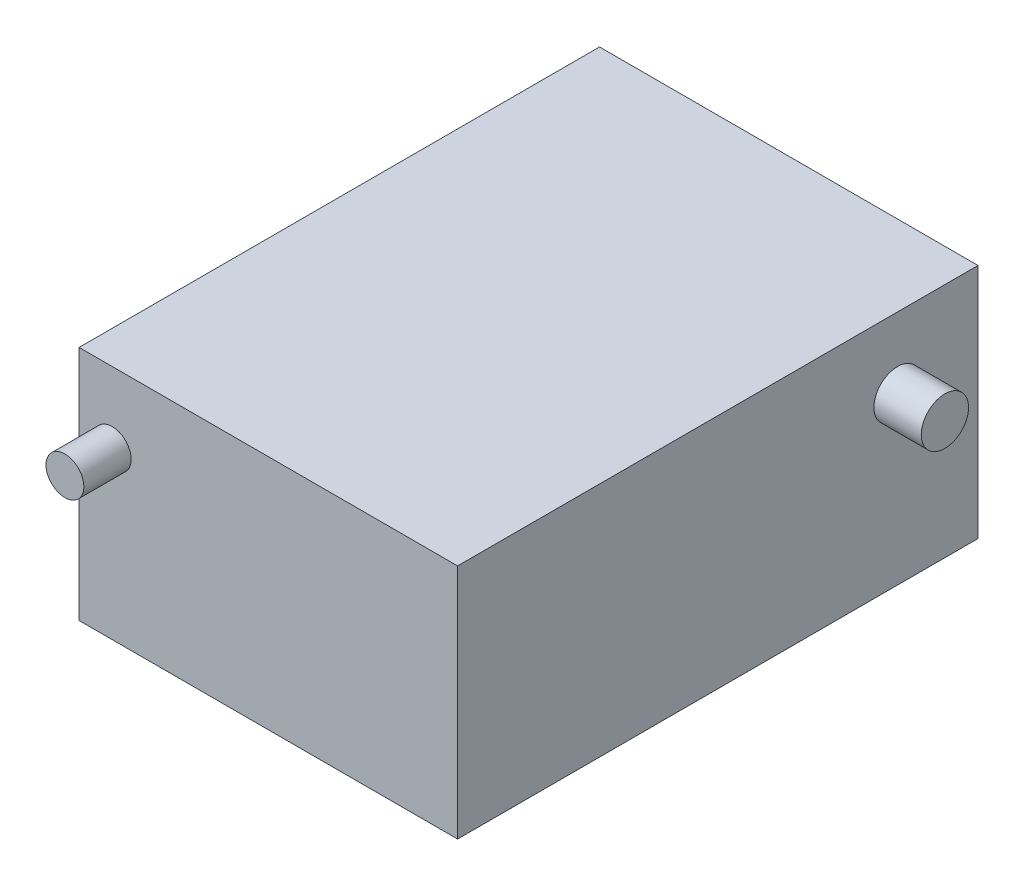
ISO-10303-21;
HEADER;
FILE_DESCRIPTION(('STEP AP214'),'2;1');
FILE_NAME('part.step','',(''),(''),'','','');
FILE_SCHEMA(('AUTOMOTIVE_DESIGN { 1 0 10303 214 1 1 1 1 }'));
ENDSEC;
DATA;
#1=APPLICATION_CONTEXT('core data for automotive mechanical design processes');
#2=APPLICATION_PROTOCOL_DEFINITION('international standard','automotive_design',2000,#1);
#3=PRODUCT_CONTEXT('',#1,'mechanical');
#4=PRODUCT('Part','Part','',(#3));
#5=PRODUCT_RELATED_PRODUCT_CATEGORY('part','',(#4));
#6=PRODUCT_DEFINITION_FORMATION('','',#4);
#7=PRODUCT_DEFINITION_CONTEXT('part definition',#1,'design');
#8=PRODUCT_DEFINITION('design','',#6,#7);
#9=PRODUCT_DEFINITION_SHAPE('','',#8);
#10=(LENGTH_UNIT() NAMED_UNIT(*) SI_UNIT(.MILLI.,.METRE.));
#11=(NAMED_UNIT(*) PLANE_ANGLE_UNIT() SI_UNIT($,.RADIAN.));
#12=(NAMED_UNIT(*) SI_UNIT($,.STERADIAN.) SOLID_ANGLE_UNIT());
#13=UNCERTAINTY_MEASURE_WITH_UNIT(LENGTH_MEASURE(1.E-05),#10,'distance_accuracy_value','');
#14=(GEOMETRIC_REPRESENTATION_CONTEXT(3) GLOBAL_UNCERTAINTY_ASSIGNED_CONTEXT((#13)) GLOBAL_UNIT_ASSIGNED_CONTEXT((#10,
#11,#12)) REPRESENTATION_CONTEXT('',''));
#15=CARTESIAN_POINT('',(0.,0.,0.));
#16=DIRECTION('',(0.,0.,1.));
#17=DIRECTION('',(1.,0.,0.));
#18=AXIS2_PLACEMENT_3D('',#15,#16,#17);
#19=CARTESIAN_POINT('',(80.,0.,0.));
#20=DIRECTION('',(0.,0.,-1.));
#21=DIRECTION('',(-1.,0.,0.));
#22=AXIS2_PLACEMENT_3D('',#19,#20,#21);
#23=PLANE('',#22);
#24=CARTESIAN_POINT('',(7.,35.,0.));
#25=DIRECTION('',(0.,0.,-1.));
#26=DIRECTION('',(-1.,0.,0.));
#27=AXIS2_PLACEMENT_3D('',#24,#25,#26);
#28=CIRCLE('',#27,4.);
#29=CARTESIAN_POINT('',(3.,35.,0.));
#30=VERTEX_POINT('',#29);
#31=EDGE_CURVE('E48',#30,#30,#28,.F.);
#32=ORIENTED_EDGE('',*,*,#31,.F.);
#33=EDGE_LOOP('',(#32));
#34=FACE_BOUND('',#33,.T.);
#35=DIRECTION('',(0.,-1.,0.));
#36=VECTOR('',#35,1.);
#37=CARTESIAN_POINT('',(0.,0.,0.));
#38=LINE('',#37,#36);
#39=CARTESIAN_POINT('',(0.,50.,0.));
#40=VERTEX_POINT('',#39);
#41=CARTESIAN_POINT('',(0.,0.,0.));
#42=VERTEX_POINT('',#41);
#43=EDGE_CURVE('E111',#40,#42,#38,.T.);
#44=ORIENTED_EDGE('',*,*,#43,.T.);
#45=DIRECTION('',(-1.,0.,0.));
#46=VECTOR('',#45,1.);
#47=CARTESIAN_POINT('',(80.,0.,0.));
#48=LINE('',#47,#46);
#49=CARTESIAN_POINT('',(80.,0.,0.));
#50=VERTEX_POINT('',#49);
#51=EDGE_CURVE('E100',#50,#42,#48,.T.);
#52=ORIENTED_EDGE('',*,*,#51,.F.);
#53=DIRECTION('',(0.,-1.,0.));
#54=VECTOR('',#53,1.);
#55=CARTESIAN_POINT('',(80.,0.,0.));
#56=LINE('',#55,#54);
#57=CARTESIAN_POINT('',(80.,50.,0.));
#58=VERTEX_POINT('',#57);
#59=EDGE_CURVE('E92',#58,#50,#56,.T.);
#60=ORIENTED_EDGE('',*,*,#59,.F.);
#61=DIRECTION('',(-1.,0.,0.));
#62=VECTOR('',#61,1.);
#63=CARTESIAN_POINT('',(80.,50.,0.));
#64=LINE('',#63,#62);
#65=EDGE_CURVE('E107',#58,#40,#64,.T.);
#66=ORIENTED_EDGE('',*,*,#65,.T.);
#67=EDGE_LOOP('',(#44,#52,#60,#66));
#68=FACE_BOUND('',#67,.T.);
#69=ADVANCED_FACE('F39',(#34,#68),#23,.F.);
#70=CARTESIAN_POINT('',(80.,0.,0.));
#71=DIRECTION('',(0.,1.,0.));
#72=DIRECTION('',(0.,0.,1.));
#73=AXIS2_PLACEMENT_3D('',#70,#71,#72);
#74=PLANE('',#73);
#75=DIRECTION('',(0.,0.,-1.));
#76=VECTOR('',#75,1.);
#77=CARTESIAN_POINT('',(0.,0.,0.));
#78=LINE('',#77,#76);
#79=CARTESIAN_POINT('',(0.,0.,-110.));
#80=VERTEX_POINT('',#79);
#81=EDGE_CURVE('E98',#42,#80,#78,.T.);
#82=ORIENTED_EDGE('',*,*,#81,.T.);
#83=DIRECTION('',(-1.,0.,0.));
#84=VECTOR('',#83,1.);
#85=CARTESIAN_POINT('',(80.,0.,-110.));
#86=LINE('',#85,#84);
#87=CARTESIAN_POINT('',(80.,0.,-110.));
#88=VERTEX_POINT('',#87);
#89=EDGE_CURVE('E96',#88,#80,#86,.T.);
#90=ORIENTED_EDGE('',*,*,#89,.F.);
#91=DIRECTION('',(0.,0.,-1.));
#92=VECTOR('',#91,1.);
#93=CARTESIAN_POINT('',(80.,0.,0.));
#94=LINE('',#93,#92);
#95=EDGE_CURVE('E87',#50,#88,#94,.T.);
#96=ORIENTED_EDGE('',*,*,#95,.F.);
#97=ORIENTED_EDGE('',*,*,#51,.T.);
#98=EDGE_LOOP('',(#82,#90,#96,#97));
#99=FACE_BOUND('',#98,.T.);
#100=ADVANCED_FACE('F97',(#99),#74,.F.);
#101=CARTESIAN_POINT('',(80.,0.,-110.));
#102=DIRECTION('',(0.,0.,1.));
#103=DIRECTION('',(1.,0.,0.));
#104=AXIS2_PLACEMENT_3D('',#101,#102,#103);
#105=PLANE('',#104);
#106=DIRECTION('',(0.,1.,0.));
#107=VECTOR('',#106,1.);
#108=CARTESIAN_POINT('',(0.,0.,-110.));
#109=LINE('',#108,#107);
#110=CARTESIAN_POINT('',(0.,50.,-110.));
#111=VERTEX_POINT('',#110);
#112=EDGE_CURVE('E73',#80,#111,#109,.T.);
#113=ORIENTED_EDGE('',*,*,#112,.T.);
#114=DIRECTION('',(-1.,0.,0.));
#115=VECTOR('',#114,1.);
#116=CARTESIAN_POINT('',(80.,50.,-110.));
#117=LINE('',#116,#115);
#118=CARTESIAN_POINT('',(80.,50.,-110.));
#119=VERTEX_POINT('',#118);
#120=EDGE_CURVE('E101',#119,#111,#117,.T.);
#121=ORIENTED_EDGE('',*,*,#120,.F.);
#122=DIRECTION('',(0.,1.,0.));
#123=VECTOR('',#122,1.);
#124=CARTESIAN_POINT('',(80.,0.,-110.));
#125=LINE('',#124,#123);
#126=EDGE_CURVE('E90',#88,#119,#125,.T.);
#127=ORIENTED_EDGE('',*,*,#126,.F.);
#128=ORIENTED_EDGE('',*,*,#89,.T.);
#129=EDGE_LOOP('',(#113,#121,#127,#128));
#130=FACE_BOUND('',#129,.T.);
#131=ADVANCED_FACE('F103',(#130),#105,.F.);
#132=CARTESIAN_POINT('',(80.,50.,0.));
#133=DIRECTION('',(0.,-1.,0.));
#134=DIRECTION('',(0.,0.,-1.));
#135=AXIS2_PLACEMENT_3D('',#132,#133,#134);
#136=PLANE('',#135);
#137=DIRECTION('',(0.,0.,1.));
#138=VECTOR('',#137,1.);
#139=CARTESIAN_POINT('',(0.,50.,0.));
#140=LINE('',#139,#138);
#141=EDGE_CURVE('E79',#111,#40,#140,.T.);
#142=ORIENTED_EDGE('',*,*,#141,.T.);
#143=ORIENTED_EDGE('',*,*,#65,.F.);
#144=DIRECTION('',(0.,0.,1.));
#145=VECTOR('',#144,1.);
#146=CARTESIAN_POINT('',(80.,50.,0.));
#147=LINE('',#146,#145);
#148=EDGE_CURVE('E56',#119,#58,#147,.T.);
#149=ORIENTED_EDGE('',*,*,#148,.F.);
#150=ORIENTED_EDGE('',*,*,#120,.T.);
#151=EDGE_LOOP('',(#142,#143,#149,#150));
#152=FACE_BOUND('',#151,.T.);
#153=ADVANCED_FACE('F147',(#152),#136,.F.);
#154=CARTESIAN_POINT('',(80.,0.,0.));
#155=DIRECTION('',(-1.,0.,0.));
#156=DIRECTION('',(0.,0.,1.));
#157=AXIS2_PLACEMENT_3D('',#154,#155,#156);
#158=PLANE('',#157);
#159=CARTESIAN_POINT('',(80.,35.,-93.));
#160=DIRECTION('',(-1.,0.,0.));
#161=DIRECTION('',(0.,0.,1.));
#162=AXIS2_PLACEMENT_3D('',#159,#160,#161);
#163=CIRCLE('',#162,5.00000000000001);
#164=CARTESIAN_POINT('',(80.,35.,-88.));
#165=VERTEX_POINT('',#164);
#166=EDGE_CURVE('E11',#165,#165,#163,.F.);
#167=ORIENTED_EDGE('',*,*,#166,.F.);
#168=EDGE_LOOP('',(#167));
#169=FACE_BOUND('',#168,.T.);
#170=ORIENTED_EDGE('',*,*,#59,.T.);
#171=ORIENTED_EDGE('',*,*,#95,.T.);
#172=ORIENTED_EDGE('',*,*,#126,.T.);
#173=ORIENTED_EDGE('',*,*,#148,.T.);
#174=EDGE_LOOP('',(#170,#171,#172,#173));
#175=FACE_BOUND('',#174,.T.);
#176=ADVANCED_FACE('F88',(#169,#175),#158,.F.);
#177=CARTESIAN_POINT('',(0.,0.,0.));
#178=DIRECTION('',(-1.,0.,0.));
#179=DIRECTION('',(0.,0.,1.));
#180=AXIS2_PLACEMENT_3D('',#177,#178,#179);
#181=PLANE('',#180);
#182=ORIENTED_EDGE('',*,*,#43,.F.);
#183=ORIENTED_EDGE('',*,*,#141,.F.);
#184=ORIENTED_EDGE('',*,*,#112,.F.);
#185=ORIENTED_EDGE('',*,*,#81,.F.);
#186=EDGE_LOOP('',(#182,#183,#184,#185));
#187=FACE_BOUND('',#186,.T.);
#188=ADVANCED_FACE('F137',(#187),#181,.T.);
#189=CARTESIAN_POINT('',(7.,35.,10.));
#190=DIRECTION('',(0.,0.,-1.));
#191=DIRECTION('',(-1.,0.,0.));
#192=AXIS2_PLACEMENT_3D('',#189,#190,#191);
#193=CYLINDRICAL_SURFACE('',#192,4.);
#194=CARTESIAN_POINT('',(7.,35.,10.));
#195=DIRECTION('',(0.,0.,1.));
#196=DIRECTION('',(1.,0.,0.));
#197=AXIS2_PLACEMENT_3D('',#194,#195,#196);
#198=CIRCLE('',#197,4.);
#199=CARTESIAN_POINT('',(11.,35.,10.));
#200=VERTEX_POINT('',#199);
#201=EDGE_CURVE('E115',#200,#200,#198,.T.);
#202=ORIENTED_EDGE('',*,*,#201,.F.);
#203=EDGE_LOOP('',(#202));
#204=FACE_BOUND('',#203,.T.);
#205=ORIENTED_EDGE('',*,*,#31,.T.);
#206=EDGE_LOOP('',(#205));
#207=FACE_BOUND('',#206,.T.);
#208=ADVANCED_FACE('F131',(#204,#207),#193,.T.);
#209=CARTESIAN_POINT('',(7.,35.,10.));
#210=DIRECTION('',(0.,0.,1.));
#211=DIRECTION('',(1.,0.,0.));
#212=AXIS2_PLACEMENT_3D('',#209,#210,#211);
#213=PLANE('',#212);
#214=ORIENTED_EDGE('',*,*,#201,.T.);
#215=EDGE_LOOP('',(#214));
#216=FACE_BOUND('',#215,.T.);
#217=ADVANCED_FACE('F144',(#216),#213,.T.);
#218=CARTESIAN_POINT('',(90.,35.,-93.));
#219=DIRECTION('',(-1.,0.,0.));
#220=DIRECTION('',(0.,0.,1.));
#221=AXIS2_PLACEMENT_3D('',#218,#219,#220);
#222=CYLINDRICAL_SURFACE('',#221,5.00000000000001);
#223=CARTESIAN_POINT('',(90.,35.,-93.));
#224=DIRECTION('',(1.,0.,0.));
#225=DIRECTION('',(0.,0.,-1.));
#226=AXIS2_PLACEMENT_3D('',#223,#224,#225);
#227=CIRCLE('',#226,5.00000000000001);
#228=CARTESIAN_POINT('',(90.,35.,-98.));
#229=VERTEX_POINT('',#228);
#230=EDGE_CURVE('E208',#229,#229,#227,.T.);
#231=ORIENTED_EDGE('',*,*,#230,.F.);
#232=EDGE_LOOP('',(#231));
#233=FACE_BOUND('',#232,.T.);
#234=ORIENTED_EDGE('',*,*,#166,.T.);
#235=EDGE_LOOP('',(#234));
#236=FACE_BOUND('',#235,.T.);
#237=ADVANCED_FACE('F182',(#233,#236),#222,.T.);
#238=CARTESIAN_POINT('',(90.,35.,-93.));
#239=DIRECTION('',(1.,0.,0.));
#240=DIRECTION('',(0.,0.,-1.));
#241=AXIS2_PLACEMENT_3D('',#238,#239,#240);
#242=PLANE('',#241);
#243=ORIENTED_EDGE('',*,*,#230,.T.);
#244=EDGE_LOOP('',(#243));
#245=FACE_BOUND('',#244,.T.);
#246=ADVANCED_FACE('F187',(#245),#242,.T.);
#247=CLOSED_SHELL('',(#69,#100,#131,#153,#176,#188,#208,#217,#237,#246));
#248=MANIFOLD_SOLID_BREP('B2',#247);
#249=ADVANCED_BREP_SHAPE_REPRESENTATION('',(#18,#248),#14);
#250=SHAPE_DEFINITION_REPRESENTATION(#9,#249);
ENDSEC;
END-ISO-10303-21;
